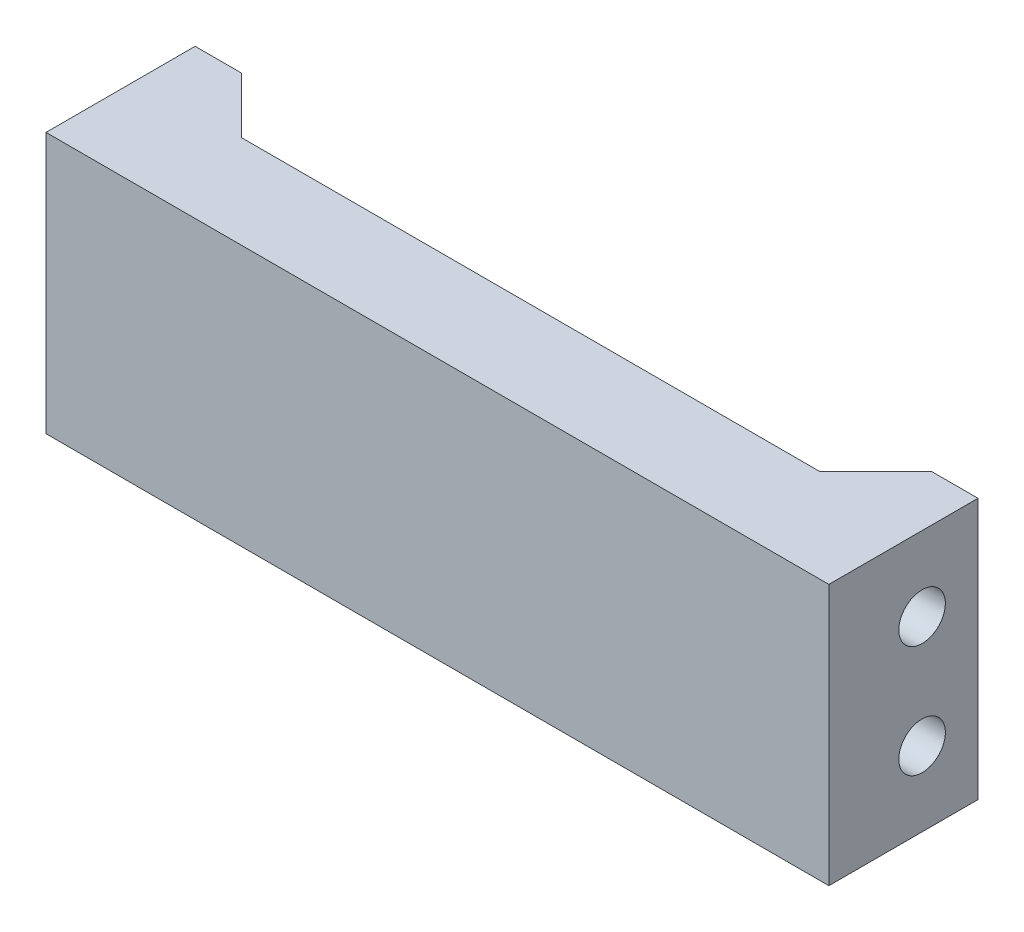
ISO-10303-21;
HEADER;
FILE_DESCRIPTION(('STEP AP214'),'2;1');
FILE_NAME('part.step','',(''),(''),'','','');
FILE_SCHEMA(('AUTOMOTIVE_DESIGN { 1 0 10303 214 1 1 1 1 }'));
ENDSEC;
DATA;
#1=APPLICATION_CONTEXT('core data for automotive mechanical design processes');
#2=APPLICATION_PROTOCOL_DEFINITION('international standard','automotive_design',2000,#1);
#3=PRODUCT_CONTEXT('',#1,'mechanical');
#4=PRODUCT('Part','Part','',(#3));
#5=PRODUCT_RELATED_PRODUCT_CATEGORY('part','',(#4));
#6=PRODUCT_DEFINITION_FORMATION('','',#4);
#7=PRODUCT_DEFINITION_CONTEXT('part definition',#1,'design');
#8=PRODUCT_DEFINITION('design','',#6,#7);
#9=PRODUCT_DEFINITION_SHAPE('','',#8);
#10=(LENGTH_UNIT() NAMED_UNIT(*) SI_UNIT(.MILLI.,.METRE.));
#11=(NAMED_UNIT(*) PLANE_ANGLE_UNIT() SI_UNIT($,.RADIAN.));
#12=(NAMED_UNIT(*) SI_UNIT($,.STERADIAN.) SOLID_ANGLE_UNIT());
#13=UNCERTAINTY_MEASURE_WITH_UNIT(LENGTH_MEASURE(1.E-05),#10,'distance_accuracy_value','');
#14=(GEOMETRIC_REPRESENTATION_CONTEXT(3) GLOBAL_UNCERTAINTY_ASSIGNED_CONTEXT((#13)) GLOBAL_UNIT_ASSIGNED_CONTEXT((#10,
#11,#12)) REPRESENTATION_CONTEXT('',''));
#15=CARTESIAN_POINT('',(0.,0.,0.));
#16=DIRECTION('',(0.,0.,1.));
#17=DIRECTION('',(1.,0.,0.));
#18=AXIS2_PLACEMENT_3D('',#15,#16,#17);
#19=CARTESIAN_POINT('',(0.,0.,0.));
#20=DIRECTION('',(0.,0.,1.));
#21=DIRECTION('',(1.,0.,0.));
#22=AXIS2_PLACEMENT_3D('',#19,#20,#21);
#23=PLANE('',#22);
#24=DIRECTION('',(0.,1.,0.));
#25=VECTOR('',#24,1.);
#26=CARTESIAN_POINT('',(18.5,7.,0.));
#27=LINE('',#26,#25);
#28=CARTESIAN_POINT('',(18.5,-5.,-1.92554305833425E-13));
#29=VERTEX_POINT('',#28);
#30=CARTESIAN_POINT('',(18.5,5.,-1.92554305833425E-13));
#31=VERTEX_POINT('',#30);
#32=EDGE_CURVE('E241',#29,#31,#27,.T.);
#33=ORIENTED_EDGE('',*,*,#32,.F.);
#34=DIRECTION('',(1.,0.,0.));
#35=VECTOR('',#34,1.);
#36=CARTESIAN_POINT('',(18.5,-5.,-1.92554305833425E-13));
#37=LINE('',#36,#35);
#38=CARTESIAN_POINT('',(-18.5,-5.,0.));
#39=VERTEX_POINT('',#38);
#40=EDGE_CURVE('E168',#39,#29,#37,.T.);
#41=ORIENTED_EDGE('',*,*,#40,.F.);
#42=DIRECTION('',(0.,-1.,0.));
#43=VECTOR('',#42,1.);
#44=CARTESIAN_POINT('',(-18.5,7.00000000000002,0.));
#45=LINE('',#44,#43);
#46=CARTESIAN_POINT('',(-18.5,5.,0.));
#47=VERTEX_POINT('',#46);
#48=EDGE_CURVE('E227',#47,#39,#45,.T.);
#49=ORIENTED_EDGE('',*,*,#48,.F.);
#50=DIRECTION('',(1.,0.,0.));
#51=VECTOR('',#50,1.);
#52=CARTESIAN_POINT('',(-18.5,5.,0.));
#53=LINE('',#52,#51);
#54=EDGE_CURVE('E182',#47,#31,#53,.T.);
#55=ORIENTED_EDGE('',*,*,#54,.T.);
#56=EDGE_LOOP('',(#33,#41,#49,#55));
#57=FACE_BOUND('',#56,.T.);
#58=ADVANCED_FACE('F33',(#57),#23,.F.);
#59=CARTESIAN_POINT('',(21.,7.,2.));
#60=DIRECTION('',(-1.,0.,0.));
#61=DIRECTION('',(0.,0.,1.));
#62=AXIS2_PLACEMENT_3D('',#59,#60,#61);
#63=PLANE('',#62);
#64=CARTESIAN_POINT('',(21.,3.,-3.));
#65=DIRECTION('',(1.,0.,0.));
#66=DIRECTION('',(0.,0.,-1.));
#67=AXIS2_PLACEMENT_3D('',#64,#65,#66);
#68=CIRCLE('',#67,1.25);
#69=CARTESIAN_POINT('',(21.,3.,-4.25));
#70=VERTEX_POINT('',#69);
#71=EDGE_CURVE('E213',#70,#70,#68,.T.);
#72=ORIENTED_EDGE('',*,*,#71,.F.);
#73=EDGE_LOOP('',(#72));
#74=FACE_BOUND('',#73,.T.);
#75=CARTESIAN_POINT('',(21.,-3.,-3.));
#76=DIRECTION('',(1.,0.,0.));
#77=DIRECTION('',(0.,0.,1.));
#78=AXIS2_PLACEMENT_3D('',#75,#76,#77);
#79=CIRCLE('',#78,1.25);
#80=CARTESIAN_POINT('',(21.,-3.,-1.75));
#81=VERTEX_POINT('',#80);
#82=EDGE_CURVE('E204',#81,#81,#79,.T.);
#83=ORIENTED_EDGE('',*,*,#82,.F.);
#84=EDGE_LOOP('',(#83));
#85=FACE_BOUND('',#84,.T.);
#86=DIRECTION('',(0.,0.,-1.));
#87=VECTOR('',#86,1.);
#88=CARTESIAN_POINT('',(21.,-7.,2.));
#89=LINE('',#88,#87);
#90=CARTESIAN_POINT('',(21.,-7.,2.));
#91=VERTEX_POINT('',#90);
#92=CARTESIAN_POINT('',(21.,-7.,-6.));
#93=VERTEX_POINT('',#92);
#94=EDGE_CURVE('E265',#91,#93,#89,.T.);
#95=ORIENTED_EDGE('',*,*,#94,.T.);
#96=DIRECTION('',(0.,-1.,0.));
#97=VECTOR('',#96,1.);
#98=CARTESIAN_POINT('',(21.,7.,-6.));
#99=LINE('',#98,#97);
#100=CARTESIAN_POINT('',(21.,7.,-6.));
#101=VERTEX_POINT('',#100);
#102=EDGE_CURVE('E244',#101,#93,#99,.T.);
#103=ORIENTED_EDGE('',*,*,#102,.F.);
#104=DIRECTION('',(0.,0.,-1.));
#105=VECTOR('',#104,1.);
#106=CARTESIAN_POINT('',(21.,7.,2.));
#107=LINE('',#106,#105);
#108=CARTESIAN_POINT('',(21.,7.,2.));
#109=VERTEX_POINT('',#108);
#110=EDGE_CURVE('E11',#109,#101,#107,.T.);
#111=ORIENTED_EDGE('',*,*,#110,.F.);
#112=DIRECTION('',(0.,1.,0.));
#113=VECTOR('',#112,1.);
#114=CARTESIAN_POINT('',(21.,7.,2.));
#115=LINE('',#114,#113);
#116=EDGE_CURVE('E257',#91,#109,#115,.T.);
#117=ORIENTED_EDGE('',*,*,#116,.F.);
#118=EDGE_LOOP('',(#95,#103,#111,#117));
#119=FACE_BOUND('',#118,.T.);
#120=ADVANCED_FACE('F35',(#74,#85,#119),#63,.F.);
#121=CARTESIAN_POINT('',(-21.,7.,2.));
#122=DIRECTION('',(0.,-1.,0.));
#123=DIRECTION('',(0.,0.,-1.));
#124=AXIS2_PLACEMENT_3D('',#121,#122,#123);
#125=PLANE('',#124);
#126=ORIENTED_EDGE('',*,*,#110,.T.);
#127=DIRECTION('',(1.,0.,0.));
#128=VECTOR('',#127,1.);
#129=CARTESIAN_POINT('',(21.,7.,-6.));
#130=LINE('',#129,#128);
#131=CARTESIAN_POINT('',(18.4999999999999,7.,-6.00000000000019));
#132=VERTEX_POINT('',#131);
#133=EDGE_CURVE('E254',#132,#101,#130,.T.);
#134=ORIENTED_EDGE('',*,*,#133,.F.);
#135=DIRECTION('',(-0.70710678118654,0.,0.707106781186555));
#136=VECTOR('',#135,1.);
#137=CARTESIAN_POINT('',(18.4999999999999,7.,-6.00000000000019));
#138=LINE('',#137,#136);
#139=CARTESIAN_POINT('',(15.5,7.,-3.00000000000016));
#140=VERTEX_POINT('',#139);
#141=EDGE_CURVE('E197',#132,#140,#138,.T.);
#142=ORIENTED_EDGE('',*,*,#141,.T.);
#143=DIRECTION('',(-1.,0.,0.));
#144=VECTOR('',#143,1.);
#145=CARTESIAN_POINT('',(-15.5,7.,-3.));
#146=LINE('',#145,#144);
#147=CARTESIAN_POINT('',(-15.5,7.,-3.));
#148=VERTEX_POINT('',#147);
#149=EDGE_CURVE('E179',#140,#148,#146,.T.);
#150=ORIENTED_EDGE('',*,*,#149,.T.);
#151=DIRECTION('',(-0.707106781186548,0.,-0.707106781186548));
#152=VECTOR('',#151,1.);
#153=CARTESIAN_POINT('',(-18.5,7.,-6.));
#154=LINE('',#153,#152);
#155=CARTESIAN_POINT('',(-18.5,7.,-6.));
#156=VERTEX_POINT('',#155);
#157=EDGE_CURVE('E175',#148,#156,#154,.T.);
#158=ORIENTED_EDGE('',*,*,#157,.T.);
#159=DIRECTION('',(1.,0.,0.));
#160=VECTOR('',#159,1.);
#161=CARTESIAN_POINT('',(-21.,7.00000000000002,-6.));
#162=LINE('',#161,#160);
#163=CARTESIAN_POINT('',(-21.,7.00000000000002,-6.));
#164=VERTEX_POINT('',#163);
#165=EDGE_CURVE('E231',#164,#156,#162,.T.);
#166=ORIENTED_EDGE('',*,*,#165,.F.);
#167=DIRECTION('',(0.,0.,-1.));
#168=VECTOR('',#167,1.);
#169=CARTESIAN_POINT('',(-21.,7.,2.));
#170=LINE('',#169,#168);
#171=CARTESIAN_POINT('',(-21.,7.,2.));
#172=VERTEX_POINT('',#171);
#173=EDGE_CURVE('E42',#172,#164,#170,.T.);
#174=ORIENTED_EDGE('',*,*,#173,.F.);
#175=DIRECTION('',(-1.,0.,0.));
#176=VECTOR('',#175,1.);
#177=CARTESIAN_POINT('',(-21.,7.,2.));
#178=LINE('',#177,#176);
#179=EDGE_CURVE('E260',#109,#172,#178,.T.);
#180=ORIENTED_EDGE('',*,*,#179,.F.);
#181=EDGE_LOOP('',(#126,#134,#142,#150,#158,#166,#174,#180));
#182=FACE_BOUND('',#181,.T.);
#183=ADVANCED_FACE('F300',(#182),#125,.F.);
#184=CARTESIAN_POINT('',(-21.,7.,2.));
#185=DIRECTION('',(1.,0.,0.));
#186=DIRECTION('',(0.,1.,0.));
#187=AXIS2_PLACEMENT_3D('',#184,#185,#186);
#188=PLANE('',#187);
#189=CARTESIAN_POINT('',(-21.,3.,-3.));
#190=DIRECTION('',(1.,0.,0.));
#191=DIRECTION('',(0.,0.,-1.));
#192=AXIS2_PLACEMENT_3D('',#189,#190,#191);
#193=CIRCLE('',#192,1.25);
#194=CARTESIAN_POINT('',(-21.,3.,-4.25));
#195=VERTEX_POINT('',#194);
#196=EDGE_CURVE('E209',#195,#195,#193,.T.);
#197=ORIENTED_EDGE('',*,*,#196,.T.);
#198=EDGE_LOOP('',(#197));
#199=FACE_BOUND('',#198,.T.);
#200=CARTESIAN_POINT('',(-21.,-3.,-3.));
#201=DIRECTION('',(1.,0.,0.));
#202=DIRECTION('',(0.,0.,1.));
#203=AXIS2_PLACEMENT_3D('',#200,#201,#202);
#204=CIRCLE('',#203,1.25);
#205=CARTESIAN_POINT('',(-21.,-3.,-1.75));
#206=VERTEX_POINT('',#205);
#207=EDGE_CURVE('E216',#206,#206,#204,.T.);
#208=ORIENTED_EDGE('',*,*,#207,.T.);
#209=EDGE_LOOP('',(#208));
#210=FACE_BOUND('',#209,.T.);
#211=ORIENTED_EDGE('',*,*,#173,.T.);
#212=DIRECTION('',(0.,1.,0.));
#213=VECTOR('',#212,1.);
#214=CARTESIAN_POINT('',(-21.,7.00000000000002,-6.));
#215=LINE('',#214,#213);
#216=CARTESIAN_POINT('',(-21.,-6.99999999999998,-6.));
#217=VERTEX_POINT('',#216);
#218=EDGE_CURVE('E228',#217,#164,#215,.T.);
#219=ORIENTED_EDGE('',*,*,#218,.F.);
#220=DIRECTION('',(0.,0.,-1.));
#221=VECTOR('',#220,1.);
#222=CARTESIAN_POINT('',(-21.,-7.,2.));
#223=LINE('',#222,#221);
#224=CARTESIAN_POINT('',(-21.,-7.,2.));
#225=VERTEX_POINT('',#224);
#226=EDGE_CURVE('E267',#225,#217,#223,.T.);
#227=ORIENTED_EDGE('',*,*,#226,.F.);
#228=DIRECTION('',(0.,-1.,0.));
#229=VECTOR('',#228,1.);
#230=CARTESIAN_POINT('',(-21.,7.,2.));
#231=LINE('',#230,#229);
#232=EDGE_CURVE('E262',#172,#225,#231,.T.);
#233=ORIENTED_EDGE('',*,*,#232,.F.);
#234=EDGE_LOOP('',(#211,#219,#227,#233));
#235=FACE_BOUND('',#234,.T.);
#236=ADVANCED_FACE('F310',(#199,#210,#235),#188,.F.);
#237=CARTESIAN_POINT('',(-21.,-7.,2.));
#238=DIRECTION('',(0.,1.,0.));
#239=DIRECTION('',(0.,0.,1.));
#240=AXIS2_PLACEMENT_3D('',#237,#238,#239);
#241=PLANE('',#240);
#242=ORIENTED_EDGE('',*,*,#226,.T.);
#243=DIRECTION('',(-1.,0.,0.));
#244=VECTOR('',#243,1.);
#245=CARTESIAN_POINT('',(-21.,-6.99999999999998,-6.));
#246=LINE('',#245,#244);
#247=CARTESIAN_POINT('',(-18.5,-6.99999999999999,-6.));
#248=VERTEX_POINT('',#247);
#249=EDGE_CURVE('E238',#248,#217,#246,.T.);
#250=ORIENTED_EDGE('',*,*,#249,.F.);
#251=DIRECTION('',(-0.707106781186548,0.,-0.707106781186548));
#252=VECTOR('',#251,1.);
#253=CARTESIAN_POINT('',(-18.5,-7.,-6.));
#254=LINE('',#253,#252);
#255=CARTESIAN_POINT('',(-15.5,-7.,-3.));
#256=VERTEX_POINT('',#255);
#257=EDGE_CURVE('E171',#256,#248,#254,.T.);
#258=ORIENTED_EDGE('',*,*,#257,.F.);
#259=DIRECTION('',(-1.,0.,0.));
#260=VECTOR('',#259,1.);
#261=CARTESIAN_POINT('',(-15.5,-7.,-3.));
#262=LINE('',#261,#260);
#263=CARTESIAN_POINT('',(15.5,-7.,-3.00000000000016));
#264=VERTEX_POINT('',#263);
#265=EDGE_CURVE('E151',#264,#256,#262,.T.);
#266=ORIENTED_EDGE('',*,*,#265,.F.);
#267=DIRECTION('',(-0.70710678118654,0.,0.707106781186555));
#268=VECTOR('',#267,1.);
#269=CARTESIAN_POINT('',(18.4999999999999,-7.,-6.00000000000019));
#270=LINE('',#269,#268);
#271=CARTESIAN_POINT('',(18.4999999999999,-7.,-6.00000000000019));
#272=VERTEX_POINT('',#271);
#273=EDGE_CURVE('E161',#272,#264,#270,.T.);
#274=ORIENTED_EDGE('',*,*,#273,.F.);
#275=DIRECTION('',(-1.,0.,0.));
#276=VECTOR('',#275,1.);
#277=CARTESIAN_POINT('',(21.,-7.,-6.));
#278=LINE('',#277,#276);
#279=EDGE_CURVE('E247',#93,#272,#278,.T.);
#280=ORIENTED_EDGE('',*,*,#279,.F.);
#281=ORIENTED_EDGE('',*,*,#94,.F.);
#282=DIRECTION('',(1.,0.,0.));
#283=VECTOR('',#282,1.);
#284=CARTESIAN_POINT('',(-21.,-7.,2.));
#285=LINE('',#284,#283);
#286=EDGE_CURVE('E58',#225,#91,#285,.T.);
#287=ORIENTED_EDGE('',*,*,#286,.F.);
#288=EDGE_LOOP('',(#242,#250,#258,#266,#274,#280,#281,#287));
#289=FACE_BOUND('',#288,.T.);
#290=ADVANCED_FACE('F307',(#289),#241,.F.);
#291=CARTESIAN_POINT('',(0.,0.,2.));
#292=DIRECTION('',(0.,0.,1.));
#293=DIRECTION('',(1.,0.,0.));
#294=AXIS2_PLACEMENT_3D('',#291,#292,#293);
#295=PLANE('',#294);
#296=ORIENTED_EDGE('',*,*,#116,.T.);
#297=ORIENTED_EDGE('',*,*,#179,.T.);
#298=ORIENTED_EDGE('',*,*,#232,.T.);
#299=ORIENTED_EDGE('',*,*,#286,.T.);
#300=EDGE_LOOP('',(#296,#297,#298,#299));
#301=FACE_BOUND('',#300,.T.);
#302=ADVANCED_FACE('F305',(#301),#295,.T.);
#303=CARTESIAN_POINT('',(18.5,7.,-6.));
#304=DIRECTION('',(1.,0.,0.));
#305=DIRECTION('',(0.,0.,-1.));
#306=AXIS2_PLACEMENT_3D('',#303,#304,#305);
#307=PLANE('',#306);
#308=CARTESIAN_POINT('',(18.5,3.,-3.));
#309=DIRECTION('',(1.,0.,0.));
#310=DIRECTION('',(0.,0.,-1.));
#311=AXIS2_PLACEMENT_3D('',#308,#309,#310);
#312=CIRCLE('',#311,1.25);
#313=CARTESIAN_POINT('',(18.5,3.,-4.25));
#314=VERTEX_POINT('',#313);
#315=EDGE_CURVE('E224',#314,#314,#312,.T.);
#316=ORIENTED_EDGE('',*,*,#315,.T.);
#317=EDGE_LOOP('',(#316));
#318=FACE_BOUND('',#317,.T.);
#319=CARTESIAN_POINT('',(18.5,-3.,-3.));
#320=DIRECTION('',(1.,0.,0.));
#321=DIRECTION('',(0.,0.,-1.));
#322=AXIS2_PLACEMENT_3D('',#319,#320,#321);
#323=CIRCLE('',#322,1.25);
#324=CARTESIAN_POINT('',(18.5,-3.,-4.25));
#325=VERTEX_POINT('',#324);
#326=EDGE_CURVE('E221',#325,#325,#323,.T.);
#327=ORIENTED_EDGE('',*,*,#326,.T.);
#328=EDGE_LOOP('',(#327));
#329=FACE_BOUND('',#328,.T.);
#330=DIRECTION('',(0.,1.,0.));
#331=VECTOR('',#330,1.);
#332=CARTESIAN_POINT('',(18.5,7.,-6.));
#333=LINE('',#332,#331);
#334=CARTESIAN_POINT('',(18.4999999999999,-5.,-6.00000000000019));
#335=VERTEX_POINT('',#334);
#336=CARTESIAN_POINT('',(18.4999999999999,5.,-6.00000000000019));
#337=VERTEX_POINT('',#336);
#338=EDGE_CURVE('E250',#335,#337,#333,.T.);
#339=ORIENTED_EDGE('',*,*,#338,.F.);
#340=DIRECTION('',(0.,0.,-1.));
#341=VECTOR('',#340,1.);
#342=CARTESIAN_POINT('',(18.4999999999999,-5.,-6.00000000000019));
#343=LINE('',#342,#341);
#344=EDGE_CURVE('E166',#29,#335,#343,.T.);
#345=ORIENTED_EDGE('',*,*,#344,.F.);
#346=ORIENTED_EDGE('',*,*,#32,.T.);
#347=DIRECTION('',(0.,0.,-1.));
#348=VECTOR('',#347,1.);
#349=CARTESIAN_POINT('',(18.4999999999999,5.,-6.00000000000019));
#350=LINE('',#349,#348);
#351=EDGE_CURVE('E185',#31,#337,#350,.T.);
#352=ORIENTED_EDGE('',*,*,#351,.T.);
#353=EDGE_LOOP('',(#339,#345,#346,#352));
#354=FACE_BOUND('',#353,.T.);
#355=ADVANCED_FACE('F334',(#318,#329,#354),#307,.F.);
#356=CARTESIAN_POINT('',(0.,0.,-6.));
#357=DIRECTION('',(0.,0.,-1.));
#358=DIRECTION('',(-1.,0.,0.));
#359=AXIS2_PLACEMENT_3D('',#356,#357,#358);
#360=PLANE('',#359);
#361=ORIENTED_EDGE('',*,*,#102,.T.);
#362=ORIENTED_EDGE('',*,*,#279,.T.);
#363=EDGE_CURVE('E251',#272,#335,#333,.T.);
#364=ORIENTED_EDGE('',*,*,#363,.T.);
#365=ORIENTED_EDGE('',*,*,#338,.T.);
#366=DIRECTION('',(0.,1.,0.));
#367=VECTOR('',#366,1.);
#368=CARTESIAN_POINT('',(18.4999999999999,5.,-6.00000000000019));
#369=LINE('',#368,#367);
#370=EDGE_CURVE('E194',#337,#132,#369,.T.);
#371=ORIENTED_EDGE('',*,*,#370,.T.);
#372=ORIENTED_EDGE('',*,*,#133,.T.);
#373=EDGE_LOOP('',(#361,#362,#364,#365,#371,#372));
#374=FACE_BOUND('',#373,.T.);
#375=ADVANCED_FACE('F325',(#374),#360,.T.);
#376=CARTESIAN_POINT('',(-18.5,7.00000000000002,-6.));
#377=DIRECTION('',(-1.,0.,0.));
#378=DIRECTION('',(0.,-1.,0.));
#379=AXIS2_PLACEMENT_3D('',#376,#377,#378);
#380=PLANE('',#379);
#381=CARTESIAN_POINT('',(-18.5,3.,-3.));
#382=DIRECTION('',(-1.,0.,0.));
#383=DIRECTION('',(0.,-1.,0.));
#384=AXIS2_PLACEMENT_3D('',#381,#382,#383);
#385=CIRCLE('',#384,1.25);
#386=CARTESIAN_POINT('',(-18.5,1.75,-3.));
#387=VERTEX_POINT('',#386);
#388=EDGE_CURVE('E37',#387,#387,#385,.T.);
#389=ORIENTED_EDGE('',*,*,#388,.T.);
#390=EDGE_LOOP('',(#389));
#391=FACE_BOUND('',#390,.T.);
#392=CARTESIAN_POINT('',(-18.5,-3.,-3.));
#393=DIRECTION('',(-1.,0.,0.));
#394=DIRECTION('',(0.,-1.,0.));
#395=AXIS2_PLACEMENT_3D('',#392,#393,#394);
#396=CIRCLE('',#395,1.25);
#397=CARTESIAN_POINT('',(-18.5,-4.25,-3.));
#398=VERTEX_POINT('',#397);
#399=EDGE_CURVE('E212',#398,#398,#396,.T.);
#400=ORIENTED_EDGE('',*,*,#399,.T.);
#401=EDGE_LOOP('',(#400));
#402=FACE_BOUND('',#401,.T.);
#403=ORIENTED_EDGE('',*,*,#48,.T.);
#404=DIRECTION('',(0.,0.,1.));
#405=VECTOR('',#404,1.);
#406=CARTESIAN_POINT('',(-18.5,-5.,-6.));
#407=LINE('',#406,#405);
#408=CARTESIAN_POINT('',(-18.5,-5.,-6.));
#409=VERTEX_POINT('',#408);
#410=EDGE_CURVE('E155',#409,#39,#407,.T.);
#411=ORIENTED_EDGE('',*,*,#410,.F.);
#412=DIRECTION('',(0.,-1.,0.));
#413=VECTOR('',#412,1.);
#414=CARTESIAN_POINT('',(-18.5,7.00000000000002,-6.));
#415=LINE('',#414,#413);
#416=CARTESIAN_POINT('',(-18.5,5.,-6.));
#417=VERTEX_POINT('',#416);
#418=EDGE_CURVE('E234',#417,#409,#415,.T.);
#419=ORIENTED_EDGE('',*,*,#418,.F.);
#420=DIRECTION('',(0.,0.,1.));
#421=VECTOR('',#420,1.);
#422=CARTESIAN_POINT('',(-18.5,5.,-6.));
#423=LINE('',#422,#421);
#424=EDGE_CURVE('E178',#417,#47,#423,.T.);
#425=ORIENTED_EDGE('',*,*,#424,.T.);
#426=EDGE_LOOP('',(#403,#411,#419,#425));
#427=FACE_BOUND('',#426,.T.);
#428=ADVANCED_FACE('F272',(#391,#402,#427),#380,.F.);
#429=CARTESIAN_POINT('',(0.,0.,-6.));
#430=DIRECTION('',(0.,0.,1.));
#431=DIRECTION('',(1.,0.,0.));
#432=AXIS2_PLACEMENT_3D('',#429,#430,#431);
#433=PLANE('',#432);
#434=ORIENTED_EDGE('',*,*,#218,.T.);
#435=ORIENTED_EDGE('',*,*,#165,.T.);
#436=EDGE_CURVE('E235',#156,#417,#415,.T.);
#437=ORIENTED_EDGE('',*,*,#436,.T.);
#438=ORIENTED_EDGE('',*,*,#418,.T.);
#439=DIRECTION('',(0.,-1.,0.));
#440=VECTOR('',#439,1.);
#441=CARTESIAN_POINT('',(-18.5,-5.,-6.));
#442=LINE('',#441,#440);
#443=EDGE_CURVE('E159',#409,#248,#442,.T.);
#444=ORIENTED_EDGE('',*,*,#443,.T.);
#445=ORIENTED_EDGE('',*,*,#249,.T.);
#446=EDGE_LOOP('',(#434,#435,#437,#438,#444,#445));
#447=FACE_BOUND('',#446,.T.);
#448=ADVANCED_FACE('F278',(#447),#433,.F.);
#449=CARTESIAN_POINT('',(-21.,-3.,-3.));
#450=DIRECTION('',(1.,0.,0.));
#451=DIRECTION('',(0.,0.,-1.));
#452=AXIS2_PLACEMENT_3D('',#449,#450,#451);
#453=CYLINDRICAL_SURFACE('',#452,1.25);
#454=ORIENTED_EDGE('',*,*,#207,.F.);
#455=EDGE_LOOP('',(#454));
#456=FACE_BOUND('',#455,.T.);
#457=ORIENTED_EDGE('',*,*,#399,.F.);
#458=EDGE_LOOP('',(#457));
#459=FACE_BOUND('',#458,.T.);
#460=ADVANCED_FACE('F275',(#456,#459),#453,.F.);
#461=CARTESIAN_POINT('',(-21.,3.,-3.));
#462=DIRECTION('',(1.,0.,0.));
#463=DIRECTION('',(0.,0.,-1.));
#464=AXIS2_PLACEMENT_3D('',#461,#462,#463);
#465=CYLINDRICAL_SURFACE('',#464,1.25);
#466=ORIENTED_EDGE('',*,*,#196,.F.);
#467=EDGE_LOOP('',(#466));
#468=FACE_BOUND('',#467,.T.);
#469=ORIENTED_EDGE('',*,*,#388,.F.);
#470=EDGE_LOOP('',(#469));
#471=FACE_BOUND('',#470,.T.);
#472=ADVANCED_FACE('F277',(#468,#471),#465,.F.);
#473=ORIENTED_EDGE('',*,*,#82,.T.);
#474=EDGE_LOOP('',(#473));
#475=FACE_BOUND('',#474,.T.);
#476=ORIENTED_EDGE('',*,*,#326,.F.);
#477=EDGE_LOOP('',(#476));
#478=FACE_BOUND('',#477,.T.);
#479=ADVANCED_FACE('F281',(#475,#478),#453,.F.);
#480=ORIENTED_EDGE('',*,*,#71,.T.);
#481=EDGE_LOOP('',(#480));
#482=FACE_BOUND('',#481,.T.);
#483=ORIENTED_EDGE('',*,*,#315,.F.);
#484=EDGE_LOOP('',(#483));
#485=FACE_BOUND('',#484,.T.);
#486=ADVANCED_FACE('F288',(#482,#485),#465,.F.);
#487=CARTESIAN_POINT('',(-18.5,5.,-6.));
#488=DIRECTION('',(0.707106781186548,0.,-0.707106781186547));
#489=DIRECTION('',(-0.707106781186547,0.,-0.707106781186548));
#490=AXIS2_PLACEMENT_3D('',#487,#488,#489);
#491=PLANE('',#490);
#492=ORIENTED_EDGE('',*,*,#157,.F.);
#493=DIRECTION('',(0.,1.,0.));
#494=VECTOR('',#493,1.);
#495=CARTESIAN_POINT('',(-15.5,5.,-3.));
#496=LINE('',#495,#494);
#497=CARTESIAN_POINT('',(-15.5,5.,-3.));
#498=VERTEX_POINT('',#497);
#499=EDGE_CURVE('E202',#498,#148,#496,.T.);
#500=ORIENTED_EDGE('',*,*,#499,.F.);
#501=DIRECTION('',(-0.707106781186548,0.,-0.707106781186548));
#502=VECTOR('',#501,1.);
#503=CARTESIAN_POINT('',(-18.5,5.,-6.));
#504=LINE('',#503,#502);
#505=EDGE_CURVE('E50',#498,#417,#504,.T.);
#506=ORIENTED_EDGE('',*,*,#505,.T.);
#507=ORIENTED_EDGE('',*,*,#436,.F.);
#508=EDGE_LOOP('',(#492,#500,#506,#507));
#509=FACE_BOUND('',#508,.T.);
#510=ADVANCED_FACE('F426',(#509),#491,.T.);
#511=CARTESIAN_POINT('',(-15.5,5.,-3.));
#512=DIRECTION('',(0.,0.,-1.));
#513=DIRECTION('',(-1.,0.,0.));
#514=AXIS2_PLACEMENT_3D('',#511,#512,#513);
#515=PLANE('',#514);
#516=ORIENTED_EDGE('',*,*,#149,.F.);
#517=DIRECTION('',(0.,1.,0.));
#518=VECTOR('',#517,1.);
#519=CARTESIAN_POINT('',(15.5,5.,-3.00000000000016));
#520=LINE('',#519,#518);
#521=CARTESIAN_POINT('',(15.5,5.,-3.00000000000016));
#522=VERTEX_POINT('',#521);
#523=EDGE_CURVE('E205',#522,#140,#520,.T.);
#524=ORIENTED_EDGE('',*,*,#523,.F.);
#525=DIRECTION('',(-1.,0.,0.));
#526=VECTOR('',#525,1.);
#527=CARTESIAN_POINT('',(-15.5,5.,-3.));
#528=LINE('',#527,#526);
#529=EDGE_CURVE('E191',#522,#498,#528,.T.);
#530=ORIENTED_EDGE('',*,*,#529,.T.);
#531=ORIENTED_EDGE('',*,*,#499,.T.);
#532=EDGE_LOOP('',(#516,#524,#530,#531));
#533=FACE_BOUND('',#532,.T.);
#534=ADVANCED_FACE('F346',(#533),#515,.T.);
#535=CARTESIAN_POINT('',(18.4999999999999,5.,-6.00000000000019));
#536=DIRECTION('',(-0.707106781186555,0.,-0.70710678118654));
#537=DIRECTION('',(-0.70710678118654,0.,0.707106781186555));
#538=AXIS2_PLACEMENT_3D('',#535,#536,#537);
#539=PLANE('',#538);
#540=ORIENTED_EDGE('',*,*,#141,.F.);
#541=ORIENTED_EDGE('',*,*,#370,.F.);
#542=DIRECTION('',(-0.70710678118654,0.,0.707106781186555));
#543=VECTOR('',#542,1.);
#544=CARTESIAN_POINT('',(18.4999999999999,5.,-6.00000000000019));
#545=LINE('',#544,#543);
#546=EDGE_CURVE('E188',#337,#522,#545,.T.);
#547=ORIENTED_EDGE('',*,*,#546,.T.);
#548=ORIENTED_EDGE('',*,*,#523,.T.);
#549=EDGE_LOOP('',(#540,#541,#547,#548));
#550=FACE_BOUND('',#549,.T.);
#551=ADVANCED_FACE('F349',(#550),#539,.T.);
#552=CARTESIAN_POINT('',(0.,5.,0.));
#553=DIRECTION('',(0.,-1.,0.));
#554=DIRECTION('',(0.,0.,-1.));
#555=AXIS2_PLACEMENT_3D('',#552,#553,#554);
#556=PLANE('',#555);
#557=ORIENTED_EDGE('',*,*,#505,.F.);
#558=ORIENTED_EDGE('',*,*,#529,.F.);
#559=ORIENTED_EDGE('',*,*,#546,.F.);
#560=ORIENTED_EDGE('',*,*,#351,.F.);
#561=ORIENTED_EDGE('',*,*,#54,.F.);
#562=ORIENTED_EDGE('',*,*,#424,.F.);
#563=EDGE_LOOP('',(#557,#558,#559,#560,#561,#562));
#564=FACE_BOUND('',#563,.T.);
#565=ADVANCED_FACE('F338',(#564),#556,.T.);
#566=CARTESIAN_POINT('',(-18.5,-5.,-6.));
#567=DIRECTION('',(-0.707106781186548,0.,0.707106781186547));
#568=DIRECTION('',(0.707106781186547,0.,0.707106781186548));
#569=AXIS2_PLACEMENT_3D('',#566,#567,#568);
#570=PLANE('',#569);
#571=ORIENTED_EDGE('',*,*,#257,.T.);
#572=ORIENTED_EDGE('',*,*,#443,.F.);
#573=DIRECTION('',(-0.707106781186548,0.,-0.707106781186548));
#574=VECTOR('',#573,1.);
#575=CARTESIAN_POINT('',(-18.5,-5.,-6.));
#576=LINE('',#575,#574);
#577=CARTESIAN_POINT('',(-15.5,-5.,-3.));
#578=VERTEX_POINT('',#577);
#579=EDGE_CURVE('E139',#578,#409,#576,.T.);
#580=ORIENTED_EDGE('',*,*,#579,.F.);
#581=DIRECTION('',(0.,-1.,0.));
#582=VECTOR('',#581,1.);
#583=CARTESIAN_POINT('',(-15.5,-5.,-3.));
#584=LINE('',#583,#582);
#585=EDGE_CURVE('E148',#578,#256,#584,.T.);
#586=ORIENTED_EDGE('',*,*,#585,.T.);
#587=EDGE_LOOP('',(#571,#572,#580,#586));
#588=FACE_BOUND('',#587,.T.);
#589=ADVANCED_FACE('F157',(#588),#570,.F.);
#590=CARTESIAN_POINT('',(18.4999999999999,-5.,-6.00000000000019));
#591=DIRECTION('',(0.707106781186555,0.,0.70710678118654));
#592=DIRECTION('',(0.70710678118654,0.,-0.707106781186555));
#593=AXIS2_PLACEMENT_3D('',#590,#591,#592);
#594=PLANE('',#593);
#595=ORIENTED_EDGE('',*,*,#273,.T.);
#596=DIRECTION('',(0.,-1.,0.));
#597=VECTOR('',#596,1.);
#598=CARTESIAN_POINT('',(15.5,-5.,-3.00000000000016));
#599=LINE('',#598,#597);
#600=CARTESIAN_POINT('',(15.5,-5.,-3.00000000000016));
#601=VERTEX_POINT('',#600);
#602=EDGE_CURVE('E154',#601,#264,#599,.T.);
#603=ORIENTED_EDGE('',*,*,#602,.F.);
#604=DIRECTION('',(-0.70710678118654,0.,0.707106781186555));
#605=VECTOR('',#604,1.);
#606=CARTESIAN_POINT('',(18.4999999999999,-5.,-6.00000000000019));
#607=LINE('',#606,#605);
#608=EDGE_CURVE('E142',#335,#601,#607,.T.);
#609=ORIENTED_EDGE('',*,*,#608,.F.);
#610=ORIENTED_EDGE('',*,*,#363,.F.);
#611=EDGE_LOOP('',(#595,#603,#609,#610));
#612=FACE_BOUND('',#611,.T.);
#613=ADVANCED_FACE('F331',(#612),#594,.F.);
#614=CARTESIAN_POINT('',(-15.5,-5.,-3.));
#615=DIRECTION('',(0.,0.,1.));
#616=DIRECTION('',(1.,0.,0.));
#617=AXIS2_PLACEMENT_3D('',#614,#615,#616);
#618=PLANE('',#617);
#619=ORIENTED_EDGE('',*,*,#265,.T.);
#620=ORIENTED_EDGE('',*,*,#585,.F.);
#621=DIRECTION('',(-1.,0.,0.));
#622=VECTOR('',#621,1.);
#623=CARTESIAN_POINT('',(-15.5,-5.,-3.));
#624=LINE('',#623,#622);
#625=EDGE_CURVE('E135',#601,#578,#624,.T.);
#626=ORIENTED_EDGE('',*,*,#625,.F.);
#627=ORIENTED_EDGE('',*,*,#602,.T.);
#628=EDGE_LOOP('',(#619,#620,#626,#627));
#629=FACE_BOUND('',#628,.T.);
#630=ADVANCED_FACE('F149',(#629),#618,.F.);
#631=CARTESIAN_POINT('',(0.,-5.,0.));
#632=DIRECTION('',(0.,1.,0.));
#633=DIRECTION('',(0.,0.,-1.));
#634=AXIS2_PLACEMENT_3D('',#631,#632,#633);
#635=PLANE('',#634);
#636=ORIENTED_EDGE('',*,*,#579,.T.);
#637=ORIENTED_EDGE('',*,*,#410,.T.);
#638=ORIENTED_EDGE('',*,*,#40,.T.);
#639=ORIENTED_EDGE('',*,*,#344,.T.);
#640=ORIENTED_EDGE('',*,*,#608,.T.);
#641=ORIENTED_EDGE('',*,*,#625,.T.);
#642=EDGE_LOOP('',(#636,#637,#638,#639,#640,#641));
#643=FACE_BOUND('',#642,.T.);
#644=ADVANCED_FACE('F137',(#643),#635,.T.);
#645=CLOSED_SHELL('',(#58,#120,#183,#236,#290,#302,#355,#375,#428,#448,#460,#472,#479,#486,#510,
#534,#551,#565,#589,#613,#630,#644));
#646=MANIFOLD_SOLID_BREP('B2',#645);
#647=ADVANCED_BREP_SHAPE_REPRESENTATION('',(#18,#646),#14);
#648=SHAPE_DEFINITION_REPRESENTATION(#9,#647);
ENDSEC;
END-ISO-10303-21;
